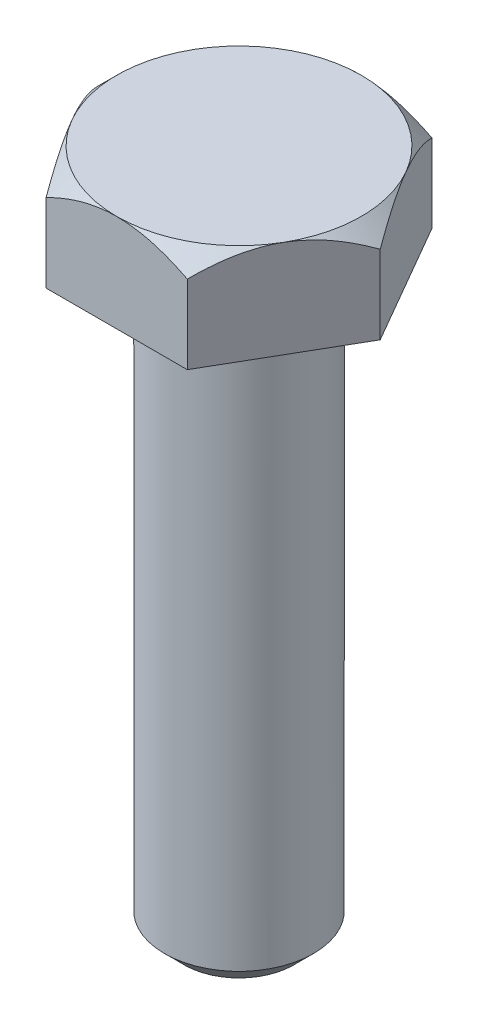
ISO-10303-21;
HEADER;
FILE_DESCRIPTION(('STEP AP214'),'2;1');
FILE_NAME('part.step','',(''),(''),'','','');
FILE_SCHEMA(('AUTOMOTIVE_DESIGN { 1 0 10303 214 1 1 1 1 }'));
ENDSEC;
DATA;
#1=APPLICATION_CONTEXT('core data for automotive mechanical design processes');
#2=APPLICATION_PROTOCOL_DEFINITION('international standard','automotive_design',2000,#1);
#3=PRODUCT_CONTEXT('',#1,'mechanical');
#4=PRODUCT('Part','Part','',(#3));
#5=PRODUCT_RELATED_PRODUCT_CATEGORY('part','',(#4));
#6=PRODUCT_DEFINITION_FORMATION('','',#4);
#7=PRODUCT_DEFINITION_CONTEXT('part definition',#1,'design');
#8=PRODUCT_DEFINITION('design','',#6,#7);
#9=PRODUCT_DEFINITION_SHAPE('','',#8);
#10=(LENGTH_UNIT() NAMED_UNIT(*) SI_UNIT(.MILLI.,.METRE.));
#11=(NAMED_UNIT(*) PLANE_ANGLE_UNIT() SI_UNIT($,.RADIAN.));
#12=(NAMED_UNIT(*) SI_UNIT($,.STERADIAN.) SOLID_ANGLE_UNIT());
#13=UNCERTAINTY_MEASURE_WITH_UNIT(LENGTH_MEASURE(1.E-05),#10,'distance_accuracy_value','');
#14=(GEOMETRIC_REPRESENTATION_CONTEXT(3) GLOBAL_UNCERTAINTY_ASSIGNED_CONTEXT((#13)) GLOBAL_UNIT_ASSIGNED_CONTEXT((#10,
#11,#12)) REPRESENTATION_CONTEXT('',''));
#15=CARTESIAN_POINT('',(0.,0.,0.));
#16=DIRECTION('',(0.,0.,1.));
#17=DIRECTION('',(1.,0.,0.));
#18=AXIS2_PLACEMENT_3D('',#15,#16,#17);
#19=CARTESIAN_POINT('',(3.62500000000007,5.,6.27868417743714));
#20=DIRECTION('',(-0.866025403784442,0.,-0.499999999999995));
#21=DIRECTION('',(-0.499999999999995,0.,0.866025403784442));
#22=AXIS2_PLACEMENT_3D('',#19,#20,#21);
#23=PLANE('',#22);
#24=CARTESIAN_POINT('',(3.62488452994624,4.02856870462476,6.27888417743714));
#25=CARTESIAN_POINT('',(3.68721389664161,4.0908916934917,6.17092654751716));
#26=CARTESIAN_POINT('',(3.75002235616352,4.15130208102734,6.06213910448007));
#27=CARTESIAN_POINT('',(3.87669145105401,4.2677158493395,5.84274179638098));
#28=CARTESIAN_POINT('',(3.94055263837515,4.32371682320785,5.73213097530909));
#29=CARTESIAN_POINT('',(4.13444955410337,4.48471046563524,5.39629166583691));
#30=CARTESIAN_POINT('',(4.26612670995196,4.58200705628878,5.16822014171098));
#31=CARTESIAN_POINT('',(4.53166422082633,4.74862075095615,4.70829568156119));
#32=CARTESIAN_POINT('',(4.66545670737727,4.81835760873348,4.47656029718399));
#33=CARTESIAN_POINT('',(4.86834501872006,4.89902600771869,4.12514743367641));
#34=CARTESIAN_POINT('',(4.93627316062514,4.92191520494596,4.00749244063306));
#35=CARTESIAN_POINT('',(5.07270459498125,4.95919667933445,3.77118626457879));
#36=CARTESIAN_POINT('',(5.14120779992591,4.97359022631844,3.65253523313333));
#37=CARTESIAN_POINT('',(5.30814078917526,4.99772308228725,3.3633988142941));
#38=CARTESIAN_POINT('',(5.40675043702598,5.0027866000747,3.19260189410018));
#39=CARTESIAN_POINT('',(5.60379200256286,4.99428769024785,2.85131589138739));
#40=CARTESIAN_POINT('',(5.70222384583931,4.98071873353769,2.68082693774991));
#41=CARTESIAN_POINT('',(5.89815953180448,4.9357547130673,2.34145637464237));
#42=CARTESIAN_POINT('',(5.99566221252046,4.9043397144273,2.17257677776813));
#43=CARTESIAN_POINT('',(6.18899174051392,4.82539152715257,1.83772021268014));
#44=CARTESIAN_POINT('',(6.28481871570106,4.77785957445157,1.67174302292037));
#45=CARTESIAN_POINT('',(6.45492849942725,4.68007191376467,1.37710423464204));
#46=CARTESIAN_POINT('',(6.52958798795453,4.63238802285783,1.2477902072457));
#47=CARTESIAN_POINT('',(6.67756674436656,4.52933616008443,0.991483482699198));
#48=CARTESIAN_POINT('',(6.75088597153632,4.47396795521828,0.864490856069481));
#49=CARTESIAN_POINT('',(6.89595327454856,4.35678861091045,0.613226916735296));
#50=CARTESIAN_POINT('',(6.96770547617939,4.29499773307909,0.488948457955774));
#51=CARTESIAN_POINT('',(7.10988123305974,4.16578428211806,0.24269282343444));
#52=CARTESIAN_POINT('',(7.18030557110013,4.09836516278837,0.120714291859081));
#53=CARTESIAN_POINT('',(7.25011547005384,4.02856870462477,-0.000200000000000499));
#54=B_SPLINE_CURVE_WITH_KNOTS('',3,(#24,#25,#26,#27,#28,#29,#30,#31,#32,#33,#34,#35,#36,#37,#38,
#39,#40,#41,#42,#43,#44,#45,#46,#47,#48,#49,#50,#51,#52,#53),.UNSPECIFIED.,.F.,.F.,(4,2,2,2,2,2,
2,2,2,2,2,2,2,2,4),(0.,0.418085081925561,0.83639681869771,1.67753646991016,2.50531966073267,
2.91839943514191,3.33141745194524,3.9223507147329,4.51349110216463,5.10529312372582,
5.69704977302065,6.16707290687592,6.63711029563191,7.10570744431351,7.57401912040438),.UNSPECIFIED.);
#55=CARTESIAN_POINT('',(3.62500000000007,4.02868417743718,6.27868417743714));
#56=VERTEX_POINT('',#55);
#57=CARTESIAN_POINT('',(5.43750000000002,5.,3.13934208871856));
#58=VERTEX_POINT('',#57);
#59=EDGE_CURVE('E110',#56,#58,#54,.T.);
#60=ORIENTED_EDGE('',*,*,#59,.F.);
#61=DIRECTION('',(0.,-1.,0.));
#62=VECTOR('',#61,1.);
#63=CARTESIAN_POINT('',(3.62500000000007,5.,6.27868417743714));
#64=LINE('',#63,#62);
#65=CARTESIAN_POINT('',(3.62500000000007,0.,6.27868417743714));
#66=VERTEX_POINT('',#65);
#67=EDGE_CURVE('E59',#56,#66,#64,.T.);
#68=ORIENTED_EDGE('',*,*,#67,.T.);
#69=DIRECTION('',(0.499999999999995,0.,-0.866025403784442));
#70=VECTOR('',#69,1.);
#71=CARTESIAN_POINT('',(3.62500000000007,0.,6.27868417743714));
#72=LINE('',#71,#70);
#73=CARTESIAN_POINT('',(7.25,0.,0.));
#74=VERTEX_POINT('',#73);
#75=EDGE_CURVE('E117',#66,#74,#72,.T.);
#76=ORIENTED_EDGE('',*,*,#75,.T.);
#77=DIRECTION('',(0.,-1.,0.));
#78=VECTOR('',#77,1.);
#79=CARTESIAN_POINT('',(7.25,5.,0.));
#80=LINE('',#79,#78);
#81=CARTESIAN_POINT('',(7.25,4.02868417743718,0.));
#82=VERTEX_POINT('',#81);
#83=EDGE_CURVE('E135',#82,#74,#80,.T.);
#84=ORIENTED_EDGE('',*,*,#83,.F.);
#85=EDGE_CURVE('E118',#58,#82,#54,.T.);
#86=ORIENTED_EDGE('',*,*,#85,.F.);
#87=EDGE_LOOP('',(#60,#68,#76,#84,#86));
#88=FACE_BOUND('',#87,.T.);
#89=ADVANCED_FACE('F36',(#88),#23,.F.);
#90=CARTESIAN_POINT('',(7.25,5.,0.));
#91=DIRECTION('',(-0.866025403784438,0.,0.500000000000001));
#92=DIRECTION('',(0.500000000000001,0.,0.866025403784438));
#93=AXIS2_PLACEMENT_3D('',#90,#91,#92);
#94=PLANE('',#93);
#95=CARTESIAN_POINT('',(7.25011547005384,4.02856870462477,0.000200000000000034));
#96=CARTESIAN_POINT('',(7.18778610335847,4.0908916934917,-0.107757629919975));
#97=CARTESIAN_POINT('',(7.12497764383655,4.15130208102734,-0.21654507295707));
#98=CARTESIAN_POINT('',(6.99830854894606,4.2677158493395,-0.435942381056166));
#99=CARTESIAN_POINT('',(6.93444736162492,4.32371682320785,-0.546553202128054));
#100=CARTESIAN_POINT('',(6.7405504458967,4.48471046563526,-0.882392511600232));
#101=CARTESIAN_POINT('',(6.6088732900481,4.58200705628879,-1.11046403572617));
#102=CARTESIAN_POINT('',(6.34333577917372,4.74862075095617,-1.57038849587596));
#103=CARTESIAN_POINT('',(6.20954329262278,4.8183576087335,-1.80212388025316));
#104=CARTESIAN_POINT('',(6.00665498127998,4.89902600771871,-2.15353674376074));
#105=CARTESIAN_POINT('',(5.9387268393749,4.92191520494598,-2.27119173680409));
#106=CARTESIAN_POINT('',(5.80229540501879,4.95919667933447,-2.50749791285837));
#107=CARTESIAN_POINT('',(5.73379220007413,4.97359022631846,-2.62614894430383));
#108=CARTESIAN_POINT('',(5.56685921082478,4.99772308228727,-2.91528536314305));
#109=CARTESIAN_POINT('',(5.46824956297406,5.00278660007473,-3.08608228333698));
#110=CARTESIAN_POINT('',(5.27120799743718,4.99428769024788,-3.42736828604976));
#111=CARTESIAN_POINT('',(5.17277615416072,4.98071873353772,-3.59785723968724));
#112=CARTESIAN_POINT('',(4.97684046819555,4.93575471306732,-3.93722780279478));
#113=CARTESIAN_POINT('',(4.87933778747957,4.90433971442733,-4.10610739966901));
#114=CARTESIAN_POINT('',(4.68600825948611,4.8253915271526,-4.44096396475701));
#115=CARTESIAN_POINT('',(4.59018128429897,4.7778595744516,-4.60694115451677));
#116=CARTESIAN_POINT('',(4.42007150057277,4.68007191376469,-4.9015799427951));
#117=CARTESIAN_POINT('',(4.34541201204549,4.63238802285786,-5.03089397019145));
#118=CARTESIAN_POINT('',(4.19743325563346,4.52933616008445,-5.28720069473796));
#119=CARTESIAN_POINT('',(4.12411402846369,4.4739679552183,-5.41419332136768));
#120=CARTESIAN_POINT('',(3.97904672545145,4.35678861091046,-5.66545726070187));
#121=CARTESIAN_POINT('',(3.90729452382061,4.2949977330791,-5.7897357194814));
#122=CARTESIAN_POINT('',(3.76511876694025,4.16578428211807,-6.03599135400274));
#123=CARTESIAN_POINT('',(3.69469442889986,4.09836516278837,-6.1579698855781));
#124=CARTESIAN_POINT('',(3.62488452994615,4.02856870462476,-6.27888417743719));
#125=B_SPLINE_CURVE_WITH_KNOTS('',3,(#95,#96,#97,#98,#99,#100,#101,#102,#103,#104,#105,#106,
#107,#108,#109,#110,#111,#112,#113,#114,#115,#116,#117,#118,#119,#120,#121,#122,#123,#124),
.UNSPECIFIED.,.F.,.F.,(4,2,2,2,2,2,2,2,2,2,2,2,2,2,4),(0.,0.418085081925567,0.83639681869772,
1.67753646991019,2.5053196607327,2.91839943514195,3.33141745194528,3.92235071473293,
4.51349110216466,5.10529312372585,5.69704977302068,6.16707290687597,6.63711029563198,
7.1057074443136,7.57401912040448),.UNSPECIFIED.);
#126=CARTESIAN_POINT('',(5.43749999999999,5.,-3.13934208871859));
#127=VERTEX_POINT('',#126);
#128=EDGE_CURVE('E125',#82,#127,#125,.T.);
#129=ORIENTED_EDGE('',*,*,#128,.F.);
#130=ORIENTED_EDGE('',*,*,#83,.T.);
#131=DIRECTION('',(-0.500000000000001,0.,-0.866025403784438));
#132=VECTOR('',#131,1.);
#133=CARTESIAN_POINT('',(7.25,0.,0.));
#134=LINE('',#133,#132);
#135=CARTESIAN_POINT('',(3.62499999999999,0.,-6.27868417743719));
#136=VERTEX_POINT('',#135);
#137=EDGE_CURVE('E398',#74,#136,#134,.T.);
#138=ORIENTED_EDGE('',*,*,#137,.T.);
#139=DIRECTION('',(0.,-1.,0.));
#140=VECTOR('',#139,1.);
#141=CARTESIAN_POINT('',(3.62499999999999,5.,-6.27868417743719));
#142=LINE('',#141,#140);
#143=CARTESIAN_POINT('',(3.62499999999999,4.02868417743718,-6.27868417743719));
#144=VERTEX_POINT('',#143);
#145=EDGE_CURVE('E204',#144,#136,#142,.T.);
#146=ORIENTED_EDGE('',*,*,#145,.F.);
#147=EDGE_CURVE('E136',#127,#144,#125,.T.);
#148=ORIENTED_EDGE('',*,*,#147,.F.);
#149=EDGE_LOOP('',(#129,#130,#138,#146,#148));
#150=FACE_BOUND('',#149,.T.);
#151=ADVANCED_FACE('F192',(#150),#94,.F.);
#152=CARTESIAN_POINT('',(3.62499999999999,5.,-6.27868417743719));
#153=DIRECTION('',(0.,0.,1.));
#154=DIRECTION('',(1.,0.,0.));
#155=AXIS2_PLACEMENT_3D('',#152,#153,#154);
#156=PLANE('',#155);
#157=CARTESIAN_POINT('',(-7.57666051860033,1.43857952280487,-6.27868417743715));
#158=CARTESIAN_POINT('',(-7.39365651230783,1.57945688959872,-6.27868417743715));
#159=CARTESIAN_POINT('',(-7.20966776392706,1.71907512434262,-6.27868417743715));
#160=CARTESIAN_POINT('',(-6.83931781583867,1.99521769306877,-6.27868417743715));
#161=CARTESIAN_POINT('',(-6.65295606622731,2.13174128876494,-6.27868417743715));
#162=CARTESIAN_POINT('',(-6.27609540777261,2.40209046760801,-6.27868417743715));
#163=CARTESIAN_POINT('',(-6.08557567548029,2.53588711812094,-6.27868417743715));
#164=CARTESIAN_POINT('',(-5.7013676758548,2.79883528544532,-6.27868417743716));
#165=CARTESIAN_POINT('',(-5.50767962786199,2.92798712185071,-6.27868417743716));
#166=CARTESIAN_POINT('',(-5.10415932230891,3.18862292545138,-6.27868417743716));
#167=CARTESIAN_POINT('',(-4.89408397797518,3.31973242959604,-6.27868417743716));
#168=CARTESIAN_POINT('',(-4.46899924146733,3.57382963916996,-6.27868417743716));
#169=CARTESIAN_POINT('',(-4.25398902548427,3.69681597506302,-6.27868417743716));
#170=CARTESIAN_POINT('',(-3.81897305439861,3.93204888921299,-6.27868417743716));
#171=CARTESIAN_POINT('',(-3.59898447967616,4.04432699068524,-6.27868417743716));
#172=CARTESIAN_POINT('',(-3.15278127156474,4.25562782816849,-6.27868417743717));
#173=CARTESIAN_POINT('',(-2.92656964053751,4.35465682564157,-6.27868417743717));
#174=CARTESIAN_POINT('',(-2.49021164331831,4.52687246842811,-6.27868417743717));
#175=CARTESIAN_POINT('',(-2.28069897147736,4.60164844585029,-6.27868417743717));
#176=CARTESIAN_POINT('',(-1.85632597962451,4.73443118921241,-6.27868417743717));
#177=CARTESIAN_POINT('',(-1.64146532079161,4.79243688972169,-6.27868417743717));
#178=CARTESIAN_POINT('',(-1.21142765694939,4.8875683886695,-6.27868417743717));
#179=CARTESIAN_POINT('',(-0.996336148218653,4.9250741683904,-6.27868417743717));
#180=CARTESIAN_POINT('',(-0.56346815275014,4.97842167925469,-6.27868417743717));
#181=CARTESIAN_POINT('',(-0.345692236177016,4.99426793349426,-6.27868417743717));
#182=CARTESIAN_POINT('',(0.0807362217716663,5.0029407360174,-6.27868417743718));
#183=CARTESIAN_POINT('',(0.289368982497101,4.99674859993676,-6.27868417743718));
#184=CARTESIAN_POINT('',(0.705011615215947,4.96394190845027,-6.27868417743718));
#185=CARTESIAN_POINT('',(0.912021338466265,4.9373255028629,-6.27868417743718));
#186=CARTESIAN_POINT('',(1.3264284221839,4.86472465401487,-6.27868417743718));
#187=CARTESIAN_POINT('',(1.53376477368789,4.81839783409703,-6.27868417743718));
#188=CARTESIAN_POINT('',(1.94386969783723,4.70894974197332,-6.27868417743718));
#189=CARTESIAN_POINT('',(2.14663852486609,4.64582940758558,-6.27868417743718));
#190=CARTESIAN_POINT('',(2.55855272468635,4.5016094654899,-6.27868417743719));
#191=CARTESIAN_POINT('',(2.76740928890636,4.41969434988626,-6.27868417743719));
#192=CARTESIAN_POINT('',(3.17975166734441,4.24320663783212,-6.27868417743719));
#193=CARTESIAN_POINT('',(3.38323501259331,4.14862833983322,-6.27868417743719));
#194=CARTESIAN_POINT('',(3.78579095692702,3.94905699505205,-6.27868417743719));
#195=CARTESIAN_POINT('',(3.98484753290937,3.84403189037483,-6.27868417743719));
#196=CARTESIAN_POINT('',(4.37839993765141,3.62587782327072,-6.27868417743719));
#197=CARTESIAN_POINT('',(4.57289646186356,3.51275010738356,-6.27868417743719));
#198=CARTESIAN_POINT('',(4.94842033299621,3.28571869098054,-6.27868417743719));
#199=CARTESIAN_POINT('',(5.12963857253774,3.17212907012057,-6.27868417743719));
#200=CARTESIAN_POINT('',(5.48896153359933,2.94011331347926,-6.2786841774372));
#201=CARTESIAN_POINT('',(5.66706602033122,2.82168681520702,-6.2786841774372));
#202=CARTESIAN_POINT('',(6.01913728036014,2.5818234603211,-6.2786841774372));
#203=CARTESIAN_POINT('',(6.19312579011556,2.46041839375126,-6.2786841774372));
#204=CARTESIAN_POINT('',(6.5387156854476,2.2143526316317,-6.2786841774372));
#205=CARTESIAN_POINT('',(6.71031771587599,2.08969284280949,-6.2786841774372));
#206=CARTESIAN_POINT('',(6.88091860823282,1.96370076934005,-6.2786841774372));
#207=B_SPLINE_CURVE_WITH_KNOTS('',3,(#157,#158,#159,#160,#161,#162,#163,#164,#165,#166,#167,
#168,#169,#170,#171,#172,#173,#174,#175,#176,#177,#178,#179,#180,#181,#182,#183,#184,#185,#186,
#187,#188,#189,#190,#191,#192,#193,#194,#195,#196,#197,#198,#199,#200,#201,#202,#203,#204,#205,
#206),.UNSPECIFIED.,.F.,.F.,(4,2,2,2,2,2,2,2,2,2,2,2,2,2,2,2,2,2,2,2,2,2,2,2,4),(0.,
0.692856158772512,1.38587590819399,2.0842410666755,2.78255808072084,3.52530650890354,
4.26817984375935,5.00879403011467,5.74905696003691,6.41585238613356,7.08269016503529,
7.73670784074358,8.39058891895184,9.01572562815278,9.64091897355062,10.2774464921539,
10.9139384719306,11.586461232698,12.2592878189047,12.9342468231889,13.6091022110665,
14.2506381722582,14.8922223007264,15.5286570401769,16.1649163294069),.UNSPECIFIED.);
#208=CARTESIAN_POINT('',(0.,5.,-6.27868417743718));
#209=VERTEX_POINT('',#208);
#210=EDGE_CURVE('E186',#144,#209,#207,.F.);
#211=ORIENTED_EDGE('',*,*,#210,.F.);
#212=ORIENTED_EDGE('',*,*,#145,.T.);
#213=DIRECTION('',(-1.,0.,0.));
#214=VECTOR('',#213,1.);
#215=CARTESIAN_POINT('',(3.62499999999999,0.,-6.27868417743719));
#216=LINE('',#215,#214);
#217=CARTESIAN_POINT('',(-3.62500000000003,0.,-6.27868417743716));
#218=VERTEX_POINT('',#217);
#219=EDGE_CURVE('E222',#136,#218,#216,.T.);
#220=ORIENTED_EDGE('',*,*,#219,.T.);
#221=DIRECTION('',(0.,-1.,0.));
#222=VECTOR('',#221,1.);
#223=CARTESIAN_POINT('',(-3.62500000000003,5.,-6.27868417743716));
#224=LINE('',#223,#222);
#225=CARTESIAN_POINT('',(-3.62500000000003,4.02868417743718,-6.27868417743716));
#226=VERTEX_POINT('',#225);
#227=EDGE_CURVE('E220',#226,#218,#224,.T.);
#228=ORIENTED_EDGE('',*,*,#227,.F.);
#229=EDGE_CURVE('E181',#209,#226,#207,.F.);
#230=ORIENTED_EDGE('',*,*,#229,.F.);
#231=EDGE_LOOP('',(#211,#212,#220,#228,#230));
#232=FACE_BOUND('',#231,.T.);
#233=ADVANCED_FACE('F188',(#232),#156,.F.);
#234=CARTESIAN_POINT('',(-3.62500000000003,5.,-6.27868417743716));
#235=DIRECTION('',(0.866025403784442,0.,0.499999999999995));
#236=DIRECTION('',(0.499999999999995,0.,-0.866025403784442));
#237=AXIS2_PLACEMENT_3D('',#234,#235,#236);
#238=PLANE('',#237);
#239=CARTESIAN_POINT('',(-3.62488452994619,4.02856870462477,-6.27888417743716));
#240=CARTESIAN_POINT('',(-3.68721389664156,4.0908916934917,-6.17092654751719));
#241=CARTESIAN_POINT('',(-3.75002235616348,4.15130208102734,-6.06213910448009));
#242=CARTESIAN_POINT('',(-3.87669145105397,4.2677158493395,-5.842741796381));
#243=CARTESIAN_POINT('',(-3.94055263837511,4.32371682320785,-5.73213097530911));
#244=CARTESIAN_POINT('',(-4.13444955410333,4.48471046563526,-5.39629166583693));
#245=CARTESIAN_POINT('',(-4.26612670995192,4.58200705628879,-5.16822014171099));
#246=CARTESIAN_POINT('',(-4.5316642208263,4.74862075095617,-4.7082956815612));
#247=CARTESIAN_POINT('',(-4.66545670737723,4.8183576087335,-4.476560297184));
#248=CARTESIAN_POINT('',(-4.86834501872003,4.89902600771871,-4.12514743367642));
#249=CARTESIAN_POINT('',(-4.93627316062511,4.92191520494598,-4.00749244063306));
#250=CARTESIAN_POINT('',(-5.07270459498122,4.95919667933447,-3.77118626457879));
#251=CARTESIAN_POINT('',(-5.14120779992588,4.97359022631847,-3.65253523313333));
#252=CARTESIAN_POINT('',(-5.30814078917523,4.99772308228727,-3.3633988142941));
#253=CARTESIAN_POINT('',(-5.40675043702595,5.00278660007473,-3.19260189410018));
#254=CARTESIAN_POINT('',(-5.60379200256283,4.99428769024788,-2.85131589138739));
#255=CARTESIAN_POINT('',(-5.70222384583928,4.98071873353772,-2.68082693774991));
#256=CARTESIAN_POINT('',(-5.89815953180445,4.93575471306732,-2.34145637464237));
#257=CARTESIAN_POINT('',(-5.99566221252043,4.90433971442733,-2.17257677776813));
#258=CARTESIAN_POINT('',(-6.18899174051389,4.8253915271526,-1.83772021268014));
#259=CARTESIAN_POINT('',(-6.28481871570103,4.7778595744516,-1.67174302292038));
#260=CARTESIAN_POINT('',(-6.45492849942722,4.68007191376469,-1.37710423464204));
#261=CARTESIAN_POINT('',(-6.5295879879545,4.63238802285786,-1.24779020724569));
#262=CARTESIAN_POINT('',(-6.67756674436654,4.52933616008446,-0.991483482699183));
#263=CARTESIAN_POINT('',(-6.7508859715363,4.4739679552183,-0.864490856069462));
#264=CARTESIAN_POINT('',(-6.89595327454855,4.35678861091046,-0.613226916735267));
#265=CARTESIAN_POINT('',(-6.96770547617938,4.2949977330791,-0.488948457955741));
#266=CARTESIAN_POINT('',(-7.10988123305973,4.16578428211807,-0.242692823434398));
#267=CARTESIAN_POINT('',(-7.18030557110012,4.09836516278837,-0.120714291859035));
#268=CARTESIAN_POINT('',(-7.25011547005384,4.02856870462476,0.000200000000050344));
#269=B_SPLINE_CURVE_WITH_KNOTS('',3,(#239,#240,#241,#242,#243,#244,#245,#246,#247,#248,#249,
#250,#251,#252,#253,#254,#255,#256,#257,#258,#259,#260,#261,#262,#263,#264,#265,#266,#267,#268),
.UNSPECIFIED.,.F.,.F.,(4,2,2,2,2,2,2,2,2,2,2,2,2,2,4),(0.,0.418085081925566,0.836396818697719,
1.67753646991018,2.5053196607327,2.91839943514195,3.33141745194527,3.92235071473293,
4.51349110216466,5.10529312372584,5.69704977302067,6.16707290687597,6.63711029563198,
7.1057074443136,7.57401912040448),.UNSPECIFIED.);
#270=CARTESIAN_POINT('',(-5.43750000000001,5.,-3.13934208871856));
#271=VERTEX_POINT('',#270);
#272=EDGE_CURVE('E187',#226,#271,#269,.T.);
#273=ORIENTED_EDGE('',*,*,#272,.F.);
#274=ORIENTED_EDGE('',*,*,#227,.T.);
#275=DIRECTION('',(-0.499999999999995,0.,0.866025403784441));
#276=VECTOR('',#275,1.);
#277=CARTESIAN_POINT('',(-3.62500000000003,0.,-6.27868417743716));
#278=LINE('',#277,#276);
#279=CARTESIAN_POINT('',(-7.25,0.,0.));
#280=VERTEX_POINT('',#279);
#281=EDGE_CURVE('E396',#218,#280,#278,.T.);
#282=ORIENTED_EDGE('',*,*,#281,.T.);
#283=DIRECTION('',(0.,-1.,0.));
#284=VECTOR('',#283,1.);
#285=CARTESIAN_POINT('',(-7.25,5.,0.));
#286=LINE('',#285,#284);
#287=CARTESIAN_POINT('',(-7.25,4.02868417743718,0.));
#288=VERTEX_POINT('',#287);
#289=EDGE_CURVE('E226',#288,#280,#286,.T.);
#290=ORIENTED_EDGE('',*,*,#289,.F.);
#291=EDGE_CURVE('E176',#271,#288,#269,.T.);
#292=ORIENTED_EDGE('',*,*,#291,.F.);
#293=EDGE_LOOP('',(#273,#274,#282,#290,#292));
#294=FACE_BOUND('',#293,.T.);
#295=ADVANCED_FACE('F191',(#294),#238,.F.);
#296=CARTESIAN_POINT('',(-7.25,5.,0.));
#297=DIRECTION('',(0.866025403784435,0.,-0.500000000000007));
#298=DIRECTION('',(-0.500000000000007,0.,-0.866025403784435));
#299=AXIS2_PLACEMENT_3D('',#296,#297,#298);
#300=PLANE('',#299);
#301=CARTESIAN_POINT('',(-7.25011547005384,4.02856870462477,-0.000199999999949406));
#302=CARTESIAN_POINT('',(-7.18778610335847,4.0908916934917,0.107757629920025));
#303=CARTESIAN_POINT('',(-7.12497764383655,4.15130208102734,0.216545072957119));
#304=CARTESIAN_POINT('',(-6.99830854894605,4.2677158493395,0.435942381056215));
#305=CARTESIAN_POINT('',(-6.93444736162491,4.32371682320785,0.546553202128102));
#306=CARTESIAN_POINT('',(-6.74055044589669,4.48471046563525,0.882392511600279));
#307=CARTESIAN_POINT('',(-6.60887329004809,4.58200705628879,1.11046403572621));
#308=CARTESIAN_POINT('',(-6.34333577917371,4.74862075095617,1.570388495876));
#309=CARTESIAN_POINT('',(-6.20954329262277,4.8183576087335,1.8021238802532));
#310=CARTESIAN_POINT('',(-6.00665498127997,4.89902600771871,2.15353674376078));
#311=CARTESIAN_POINT('',(-5.93872683937489,4.92191520494598,2.27119173680413));
#312=CARTESIAN_POINT('',(-5.80229540501878,4.95919667933447,2.50749791285841));
#313=CARTESIAN_POINT('',(-5.73379220007411,4.97359022631847,2.62614894430387));
#314=CARTESIAN_POINT('',(-5.56685921082476,4.99772308228727,2.91528536314309));
#315=CARTESIAN_POINT('',(-5.46824956297404,5.00278660007473,3.08608228333701));
#316=CARTESIAN_POINT('',(-5.27120799743715,4.99428769024788,3.4273682860498));
#317=CARTESIAN_POINT('',(-5.1727761541607,4.98071873353772,3.59785723968728));
#318=CARTESIAN_POINT('',(-4.97684046819552,4.93575471306732,3.93722780279481));
#319=CARTESIAN_POINT('',(-4.87933778747955,4.90433971442733,4.10610739966905));
#320=CARTESIAN_POINT('',(-4.68600825948608,4.8253915271526,4.44096396475704));
#321=CARTESIAN_POINT('',(-4.59018128429894,4.7778595744516,4.6069411545168));
#322=CARTESIAN_POINT('',(-4.42007150057274,4.68007191376469,4.90157994279513));
#323=CARTESIAN_POINT('',(-4.34541201204546,4.63238802285786,5.03089397019148));
#324=CARTESIAN_POINT('',(-4.19743325563342,4.52933616008446,5.28720069473799));
#325=CARTESIAN_POINT('',(-4.12411402846365,4.4739679552183,5.41419332136771));
#326=CARTESIAN_POINT('',(-3.9790467254514,4.35678861091047,5.6654572607019));
#327=CARTESIAN_POINT('',(-3.90729452382057,4.2949977330791,5.78973571948143));
#328=CARTESIAN_POINT('',(-3.76511876694021,4.16578428211807,6.03599135400277));
#329=CARTESIAN_POINT('',(-3.69469442889982,4.09836516278837,6.15796988557813));
#330=CARTESIAN_POINT('',(-3.6248845299461,4.02856870462477,6.27888417743721));
#331=B_SPLINE_CURVE_WITH_KNOTS('',3,(#301,#302,#303,#304,#305,#306,#307,#308,#309,#310,#311,
#312,#313,#314,#315,#316,#317,#318,#319,#320,#321,#322,#323,#324,#325,#326,#327,#328,#329,#330),
.UNSPECIFIED.,.F.,.F.,(4,2,2,2,2,2,2,2,2,2,2,2,2,2,4),(0.,0.418085081925566,0.836396818697719,
1.67753646991019,2.50531966073269,2.91839943514195,3.33141745194527,3.92235071473293,
4.51349110216466,5.10529312372585,5.69704977302068,6.16707290687597,6.63711029563198,
7.1057074443136,7.57401912040449),.UNSPECIFIED.);
#332=CARTESIAN_POINT('',(-5.43749999999997,5.,3.13934208871863));
#333=VERTEX_POINT('',#332);
#334=EDGE_CURVE('E381',#288,#333,#331,.T.);
#335=ORIENTED_EDGE('',*,*,#334,.F.);
#336=ORIENTED_EDGE('',*,*,#289,.T.);
#337=DIRECTION('',(0.500000000000007,0.,0.866025403784434));
#338=VECTOR('',#337,1.);
#339=CARTESIAN_POINT('',(-7.25,0.,0.));
#340=LINE('',#339,#338);
#341=CARTESIAN_POINT('',(-3.62499999999994,0.,6.27868417743721));
#342=VERTEX_POINT('',#341);
#343=EDGE_CURVE('E389',#280,#342,#340,.T.);
#344=ORIENTED_EDGE('',*,*,#343,.T.);
#345=DIRECTION('',(0.,-1.,0.));
#346=VECTOR('',#345,1.);
#347=CARTESIAN_POINT('',(-3.62499999999994,5.,6.27868417743721));
#348=LINE('',#347,#346);
#349=CARTESIAN_POINT('',(-3.62499999999994,4.02868417743718,6.27868417743721));
#350=VERTEX_POINT('',#349);
#351=EDGE_CURVE('E229',#350,#342,#348,.T.);
#352=ORIENTED_EDGE('',*,*,#351,.F.);
#353=EDGE_CURVE('E169',#333,#350,#331,.T.);
#354=ORIENTED_EDGE('',*,*,#353,.F.);
#355=EDGE_LOOP('',(#335,#336,#344,#352,#354));
#356=FACE_BOUND('',#355,.T.);
#357=ADVANCED_FACE('F309',(#356),#300,.F.);
#358=CARTESIAN_POINT('',(-3.62499999999994,5.,6.27868417743721));
#359=DIRECTION('',(0.,0.,-1.));
#360=DIRECTION('',(-1.,0.,0.));
#361=AXIS2_PLACEMENT_3D('',#358,#359,#360);
#362=PLANE('',#361);
#363=CARTESIAN_POINT('',(-7.57666051860024,1.43857952280487,6.27868417743725));
#364=CARTESIAN_POINT('',(-7.39365651230774,1.57945688959872,6.27868417743725));
#365=CARTESIAN_POINT('',(-7.20966776392697,1.71907512434262,6.27868417743725));
#366=CARTESIAN_POINT('',(-6.83931781583858,1.99521769306878,6.27868417743725));
#367=CARTESIAN_POINT('',(-6.65295606622722,2.13174128876494,6.27868417743725));
#368=CARTESIAN_POINT('',(-6.27609540777252,2.40209046760801,6.27868417743724));
#369=CARTESIAN_POINT('',(-6.0855756754802,2.53588711812094,6.27868417743724));
#370=CARTESIAN_POINT('',(-5.70136767585471,2.79883528544532,6.27868417743724));
#371=CARTESIAN_POINT('',(-5.50767962786191,2.92798712185071,6.27868417743723));
#372=CARTESIAN_POINT('',(-5.10415932230883,3.18862292545138,6.27868417743723));
#373=CARTESIAN_POINT('',(-4.89408397797509,3.31973242959604,6.27868417743723));
#374=CARTESIAN_POINT('',(-4.46899924146725,3.57382963916996,6.27868417743722));
#375=CARTESIAN_POINT('',(-4.25398902548418,3.69681597506302,6.27868417743722));
#376=CARTESIAN_POINT('',(-3.81897305439853,3.93204888921299,6.27868417743722));
#377=CARTESIAN_POINT('',(-3.59898447967608,4.04432699068524,6.27868417743721));
#378=CARTESIAN_POINT('',(-3.15278127156466,4.25562782816848,6.27868417743721));
#379=CARTESIAN_POINT('',(-2.92656964053743,4.35465682564157,6.27868417743721));
#380=CARTESIAN_POINT('',(-2.49021164331822,4.52687246842811,6.2786841774372));
#381=CARTESIAN_POINT('',(-2.28069897147728,4.60164844585029,6.2786841774372));
#382=CARTESIAN_POINT('',(-1.85632597962443,4.73443118921241,6.2786841774372));
#383=CARTESIAN_POINT('',(-1.64146532079152,4.79243688972169,6.27868417743719));
#384=CARTESIAN_POINT('',(-1.2114276569493,4.8875683886695,6.27868417743719));
#385=CARTESIAN_POINT('',(-0.996336148218567,4.9250741683904,6.27868417743719));
#386=CARTESIAN_POINT('',(-0.563468152750053,4.97842167925468,6.27868417743718));
#387=CARTESIAN_POINT('',(-0.345692236176929,4.99426793349426,6.27868417743718));
#388=CARTESIAN_POINT('',(0.0807362217717539,5.00294073601741,6.27868417743718));
#389=CARTESIAN_POINT('',(0.289368982497189,4.99674859993676,6.27868417743717));
#390=CARTESIAN_POINT('',(0.705011615216036,4.96394190845027,6.27868417743717));
#391=CARTESIAN_POINT('',(0.912021338466354,4.9373255028629,6.27868417743717));
#392=CARTESIAN_POINT('',(1.32642842218399,4.86472465401487,6.27868417743716));
#393=CARTESIAN_POINT('',(1.53376477368798,4.81839783409703,6.27868417743716));
#394=CARTESIAN_POINT('',(1.94386969783732,4.70894974197332,6.27868417743716));
#395=CARTESIAN_POINT('',(2.14663852486618,4.64582940758559,6.27868417743715));
#396=CARTESIAN_POINT('',(2.55855272468644,4.5016094654899,6.27868417743715));
#397=CARTESIAN_POINT('',(2.76740928890645,4.41969434988626,6.27868417743715));
#398=CARTESIAN_POINT('',(3.1797516673445,4.24320663783212,6.27868417743714));
#399=CARTESIAN_POINT('',(3.3832350125934,4.14862833983321,6.27868417743714));
#400=CARTESIAN_POINT('',(3.78579095692711,3.94905699505205,6.27868417743714));
#401=CARTESIAN_POINT('',(3.98484753290946,3.84403189037483,6.27868417743714));
#402=CARTESIAN_POINT('',(4.3783999376515,3.62587782327071,6.27868417743713));
#403=CARTESIAN_POINT('',(4.57289646186365,3.51275010738355,6.27868417743713));
#404=CARTESIAN_POINT('',(4.9484203329963,3.28571869098054,6.27868417743713));
#405=CARTESIAN_POINT('',(5.12963857253784,3.17212907012056,6.27868417743712));
#406=CARTESIAN_POINT('',(5.48896153359942,2.94011331347926,6.27868417743712));
#407=CARTESIAN_POINT('',(5.66706602033131,2.82168681520701,6.27868417743712));
#408=CARTESIAN_POINT('',(6.01913728036024,2.58182346032109,6.27868417743711));
#409=CARTESIAN_POINT('',(6.19312579011566,2.46041839375125,6.27868417743711));
#410=CARTESIAN_POINT('',(6.5387156854477,2.21435263163169,6.27868417743711));
#411=CARTESIAN_POINT('',(6.71031771587608,2.08969284280948,6.27868417743711));
#412=CARTESIAN_POINT('',(6.88091860823291,1.96370076934005,6.27868417743711));
#413=B_SPLINE_CURVE_WITH_KNOTS('',3,(#363,#364,#365,#366,#367,#368,#369,#370,#371,#372,#373,
#374,#375,#376,#377,#378,#379,#380,#381,#382,#383,#384,#385,#386,#387,#388,#389,#390,#391,#392,
#393,#394,#395,#396,#397,#398,#399,#400,#401,#402,#403,#404,#405,#406,#407,#408,#409,#410,#411,
#412),.UNSPECIFIED.,.F.,.F.,(4,2,2,2,2,2,2,2,2,2,2,2,2,2,2,2,2,2,2,2,2,2,2,2,4),(0.,
0.692856158772512,1.38587590819398,2.0842410666755,2.78255808072084,3.52530650890354,
4.26817984375935,5.00879403011467,5.7490569600369,6.41585238613355,7.08269016503529,
7.73670784074358,8.39058891895183,9.01572562815278,9.64091897355062,10.2774464921539,
10.9139384719306,11.586461232698,12.2592878189047,12.9342468231889,13.6091022110665,
14.2506381722582,14.8922223007265,15.5286570401769,16.1649163294069),.UNSPECIFIED.);
#414=CARTESIAN_POINT('',(0.,5.,6.27868417743717));
#415=VERTEX_POINT('',#414);
#416=EDGE_CURVE('E383',#350,#415,#413,.T.);
#417=ORIENTED_EDGE('',*,*,#416,.F.);
#418=ORIENTED_EDGE('',*,*,#351,.T.);
#419=DIRECTION('',(1.,0.,0.));
#420=VECTOR('',#419,1.);
#421=CARTESIAN_POINT('',(-3.62499999999994,0.,6.27868417743721));
#422=LINE('',#421,#420);
#423=EDGE_CURVE('E391',#342,#66,#422,.T.);
#424=ORIENTED_EDGE('',*,*,#423,.T.);
#425=ORIENTED_EDGE('',*,*,#67,.F.);
#426=EDGE_CURVE('E115',#415,#56,#413,.T.);
#427=ORIENTED_EDGE('',*,*,#426,.F.);
#428=EDGE_LOOP('',(#417,#418,#424,#425,#427));
#429=FACE_BOUND('',#428,.T.);
#430=ADVANCED_FACE('F302',(#429),#362,.F.);
#431=CARTESIAN_POINT('',(0.,0.,0.));
#432=DIRECTION('',(0.,1.,0.));
#433=DIRECTION('',(0.,0.,1.));
#434=AXIS2_PLACEMENT_3D('',#431,#432,#433);
#435=PLANE('',#434);
#436=CARTESIAN_POINT('',(0.,0.,0.));
#437=DIRECTION('',(0.,1.,0.));
#438=DIRECTION('',(0.,0.,1.));
#439=AXIS2_PLACEMENT_3D('',#436,#437,#438);
#440=CIRCLE('',#439,4.825);
#441=CARTESIAN_POINT('',(0.,0.,4.825));
#442=VERTEX_POINT('',#441);
#443=EDGE_CURVE('E236',#442,#442,#440,.T.);
#444=ORIENTED_EDGE('',*,*,#443,.T.);
#445=EDGE_LOOP('',(#444));
#446=FACE_BOUND('',#445,.T.);
#447=ORIENTED_EDGE('',*,*,#75,.F.);
#448=ORIENTED_EDGE('',*,*,#423,.F.);
#449=ORIENTED_EDGE('',*,*,#343,.F.);
#450=ORIENTED_EDGE('',*,*,#281,.F.);
#451=ORIENTED_EDGE('',*,*,#219,.F.);
#452=ORIENTED_EDGE('',*,*,#137,.F.);
#453=EDGE_LOOP('',(#447,#448,#449,#450,#451,#452));
#454=FACE_BOUND('',#453,.T.);
#455=ADVANCED_FACE('F295',(#446,#454),#435,.F.);
#456=CARTESIAN_POINT('',(0.,5.,0.));
#457=DIRECTION('',(0.,-1.,0.));
#458=DIRECTION('',(0.,0.,1.));
#459=AXIS2_PLACEMENT_3D('',#456,#457,#458);
#460=CONICAL_SURFACE('',#459,6.27868417743718,0.78539816339745);
#461=ORIENTED_EDGE('',*,*,#353,.T.);
#462=ORIENTED_EDGE('',*,*,#416,.T.);
#463=CARTESIAN_POINT('',(0.,5.,0.));
#464=DIRECTION('',(0.,1.,0.));
#465=DIRECTION('',(0.,0.,1.));
#466=AXIS2_PLACEMENT_3D('',#463,#464,#465);
#467=CIRCLE('',#466,6.27868417743718);
#468=EDGE_CURVE('E51',#333,#415,#467,.T.);
#469=ORIENTED_EDGE('',*,*,#468,.F.);
#470=EDGE_LOOP('',(#461,#462,#469));
#471=FACE_BOUND('',#470,.T.);
#472=ADVANCED_FACE('F155',(#471),#460,.T.);
#473=ORIENTED_EDGE('',*,*,#291,.T.);
#474=ORIENTED_EDGE('',*,*,#334,.T.);
#475=EDGE_CURVE('E217',#271,#333,#467,.T.);
#476=ORIENTED_EDGE('',*,*,#475,.F.);
#477=EDGE_LOOP('',(#473,#474,#476));
#478=FACE_BOUND('',#477,.T.);
#479=ADVANCED_FACE('F283',(#478),#460,.T.);
#480=ORIENTED_EDGE('',*,*,#229,.T.);
#481=ORIENTED_EDGE('',*,*,#272,.T.);
#482=EDGE_CURVE('E212',#209,#271,#467,.T.);
#483=ORIENTED_EDGE('',*,*,#482,.F.);
#484=EDGE_LOOP('',(#480,#481,#483));
#485=FACE_BOUND('',#484,.T.);
#486=ADVANCED_FACE('F213',(#485),#460,.T.);
#487=ORIENTED_EDGE('',*,*,#147,.T.);
#488=ORIENTED_EDGE('',*,*,#210,.T.);
#489=EDGE_CURVE('E130',#127,#209,#467,.T.);
#490=ORIENTED_EDGE('',*,*,#489,.F.);
#491=EDGE_LOOP('',(#487,#488,#490));
#492=FACE_BOUND('',#491,.T.);
#493=ADVANCED_FACE('F208',(#492),#460,.T.);
#494=ORIENTED_EDGE('',*,*,#85,.T.);
#495=ORIENTED_EDGE('',*,*,#128,.T.);
#496=EDGE_CURVE('E122',#58,#127,#467,.T.);
#497=ORIENTED_EDGE('',*,*,#496,.F.);
#498=EDGE_LOOP('',(#494,#495,#497));
#499=FACE_BOUND('',#498,.T.);
#500=ADVANCED_FACE('F123',(#499),#460,.T.);
#501=ORIENTED_EDGE('',*,*,#59,.T.);
#502=CARTESIAN_POINT('',(0.,5.,0.));
#503=DIRECTION('',(0.,1.,0.));
#504=DIRECTION('',(0.,0.,1.));
#505=AXIS2_PLACEMENT_3D('',#502,#503,#504);
#506=CIRCLE('',#505,6.27868417743718);
#507=EDGE_CURVE('E113',#415,#58,#506,.T.);
#508=ORIENTED_EDGE('',*,*,#507,.F.);
#509=ORIENTED_EDGE('',*,*,#426,.T.);
#510=EDGE_LOOP('',(#501,#508,#509));
#511=FACE_BOUND('',#510,.T.);
#512=ADVANCED_FACE('F112',(#511),#460,.T.);
#513=CARTESIAN_POINT('',(0.,5.,0.));
#514=DIRECTION('',(0.,1.,0.));
#515=DIRECTION('',(0.,0.,1.));
#516=AXIS2_PLACEMENT_3D('',#513,#514,#515);
#517=PLANE('',#516);
#518=ORIENTED_EDGE('',*,*,#468,.T.);
#519=ORIENTED_EDGE('',*,*,#507,.T.);
#520=ORIENTED_EDGE('',*,*,#496,.T.);
#521=ORIENTED_EDGE('',*,*,#489,.T.);
#522=ORIENTED_EDGE('',*,*,#482,.T.);
#523=ORIENTED_EDGE('',*,*,#475,.T.);
#524=EDGE_LOOP('',(#518,#519,#520,#521,#522,#523));
#525=FACE_BOUND('',#524,.T.);
#526=ADVANCED_FACE('F132',(#525),#517,.T.);
#527=CARTESIAN_POINT('',(0.,-30.,0.));
#528=DIRECTION('',(0.,1.,0.));
#529=DIRECTION('',(0.,0.,1.));
#530=AXIS2_PLACEMENT_3D('',#527,#528,#529);
#531=CYLINDRICAL_SURFACE('',#530,3.825);
#532=CARTESIAN_POINT('',(0.,-29.,0.));
#533=DIRECTION('',(0.,-1.,0.));
#534=DIRECTION('',(0.,0.,-1.));
#535=AXIS2_PLACEMENT_3D('',#532,#533,#534);
#536=CIRCLE('',#535,3.825);
#537=CARTESIAN_POINT('',(0.,-29.,-3.825));
#538=VERTEX_POINT('',#537);
#539=EDGE_CURVE('E12',#538,#538,#536,.F.);
#540=ORIENTED_EDGE('',*,*,#539,.T.);
#541=EDGE_LOOP('',(#540));
#542=FACE_BOUND('',#541,.T.);
#543=CARTESIAN_POINT('',(0.,-1.,0.));
#544=DIRECTION('',(0.,1.,0.));
#545=DIRECTION('',(0.,0.,1.));
#546=AXIS2_PLACEMENT_3D('',#543,#544,#545);
#547=CIRCLE('',#546,3.825);
#548=CARTESIAN_POINT('',(0.,-1.,3.825));
#549=VERTEX_POINT('',#548);
#550=EDGE_CURVE('E129',#549,#549,#547,.F.);
#551=ORIENTED_EDGE('',*,*,#550,.T.);
#552=EDGE_LOOP('',(#551));
#553=FACE_BOUND('',#552,.T.);
#554=ADVANCED_FACE('F156',(#542,#553),#531,.T.);
#555=CARTESIAN_POINT('',(0.,-30.,0.));
#556=DIRECTION('',(0.,-1.,0.));
#557=DIRECTION('',(0.,0.,-1.));
#558=AXIS2_PLACEMENT_3D('',#555,#556,#557);
#559=PLANE('',#558);
#560=CARTESIAN_POINT('',(0.,-30.,0.));
#561=DIRECTION('',(0.,-1.,0.));
#562=DIRECTION('',(0.,0.,-1.));
#563=AXIS2_PLACEMENT_3D('',#560,#561,#562);
#564=CIRCLE('',#563,2.825);
#565=CARTESIAN_POINT('',(0.,-30.,-2.825));
#566=VERTEX_POINT('',#565);
#567=EDGE_CURVE('E44',#566,#566,#564,.T.);
#568=ORIENTED_EDGE('',*,*,#567,.T.);
#569=EDGE_LOOP('',(#568));
#570=FACE_BOUND('',#569,.T.);
#571=ADVANCED_FACE('F241',(#570),#559,.T.);
#572=CARTESIAN_POINT('',(0.,-1.,0.));
#573=DIRECTION('',(0.,1.,0.));
#574=DIRECTION('',(0.,0.,1.));
#575=AXIS2_PLACEMENT_3D('',#572,#573,#574);
#576=TOROIDAL_SURFACE('',#575,4.825,1.);
#577=ORIENTED_EDGE('',*,*,#443,.F.);
#578=EDGE_LOOP('',(#577));
#579=FACE_BOUND('',#578,.T.);
#580=ORIENTED_EDGE('',*,*,#550,.F.);
#581=EDGE_LOOP('',(#580));
#582=FACE_BOUND('',#581,.T.);
#583=ADVANCED_FACE('F244',(#579,#582),#576,.F.);
#584=CARTESIAN_POINT('',(0.,-30.,0.));
#585=DIRECTION('',(0.,1.,0.));
#586=DIRECTION('',(0.,0.,1.));
#587=AXIS2_PLACEMENT_3D('',#584,#585,#586);
#588=CONICAL_SURFACE('',#587,2.825,0.785398163397446);
#589=ORIENTED_EDGE('',*,*,#539,.F.);
#590=EDGE_LOOP('',(#589));
#591=FACE_BOUND('',#590,.T.);
#592=ORIENTED_EDGE('',*,*,#567,.F.);
#593=EDGE_LOOP('',(#592));
#594=FACE_BOUND('',#593,.T.);
#595=ADVANCED_FACE('F38',(#591,#594),#588,.T.);
#596=CLOSED_SHELL('',(#89,#151,#233,#295,#357,#430,#455,#472,#479,#486,#493,#500,#512,#526,#554,
#571,#583,#595));
#597=MANIFOLD_SOLID_BREP('B2',#596);
#598=ADVANCED_BREP_SHAPE_REPRESENTATION('',(#18,#597),#14);
#599=SHAPE_DEFINITION_REPRESENTATION(#9,#598);
ENDSEC;
END-ISO-10303-21;
